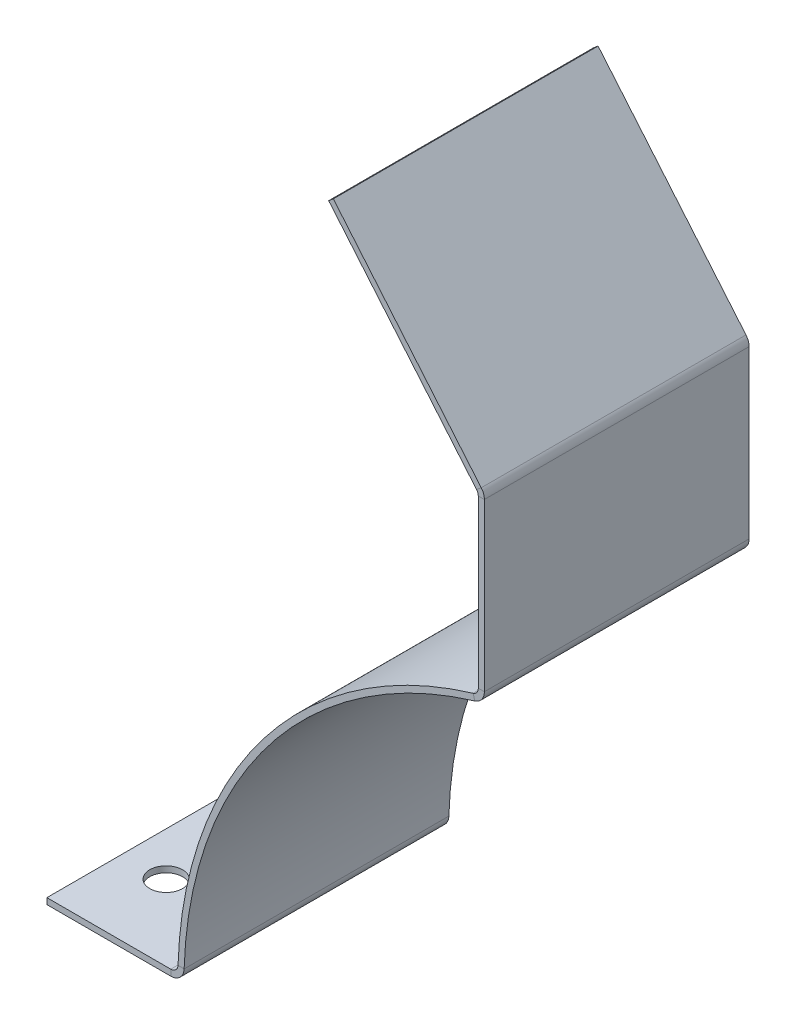
ISO-10303-21;
HEADER;
FILE_DESCRIPTION(('STEP AP214'),'2;1');
FILE_NAME('part.step','',(''),(''),'','','');
FILE_SCHEMA(('AUTOMOTIVE_DESIGN { 1 0 10303 214 1 1 1 1 }'));
ENDSEC;
DATA;
#1=APPLICATION_CONTEXT('core data for automotive mechanical design processes');
#2=APPLICATION_PROTOCOL_DEFINITION('international standard','automotive_design',2000,#1);
#3=PRODUCT_CONTEXT('',#1,'mechanical');
#4=PRODUCT('Part','Part','',(#3));
#5=PRODUCT_RELATED_PRODUCT_CATEGORY('part','',(#4));
#6=PRODUCT_DEFINITION_FORMATION('','',#4);
#7=PRODUCT_DEFINITION_CONTEXT('part definition',#1,'design');
#8=PRODUCT_DEFINITION('design','',#6,#7);
#9=PRODUCT_DEFINITION_SHAPE('','',#8);
#10=(LENGTH_UNIT() NAMED_UNIT(*) SI_UNIT(.MILLI.,.METRE.));
#11=(NAMED_UNIT(*) PLANE_ANGLE_UNIT() SI_UNIT($,.RADIAN.));
#12=(NAMED_UNIT(*) SI_UNIT($,.STERADIAN.) SOLID_ANGLE_UNIT());
#13=UNCERTAINTY_MEASURE_WITH_UNIT(LENGTH_MEASURE(1.E-05),#10,'distance_accuracy_value','');
#14=(GEOMETRIC_REPRESENTATION_CONTEXT(3) GLOBAL_UNCERTAINTY_ASSIGNED_CONTEXT((#13)) GLOBAL_UNIT_ASSIGNED_CONTEXT((#10,
#11,#12)) REPRESENTATION_CONTEXT('',''));
#15=CARTESIAN_POINT('',(0.,0.,0.));
#16=DIRECTION('',(0.,0.,1.));
#17=DIRECTION('',(1.,0.,0.));
#18=AXIS2_PLACEMENT_3D('',#15,#16,#17);
#19=CARTESIAN_POINT('',(-46.6343359967597,173.610704407755,0.));
#20=DIRECTION('',(0.,0.,-1.));
#21=DIRECTION('',(-1.,0.,0.));
#22=AXIS2_PLACEMENT_3D('',#19,#20,#21);
#23=PLANE('',#22);
#24=DIRECTION('',(-2.70456049811991E-05,0.999999999634268,0.));
#25=VECTOR('',#24,1.);
#26=CARTESIAN_POINT('',(-49.286498840737,0.67476912651559,0.));
#27=LINE('',#26,#25);
#28=CARTESIAN_POINT('',(-49.2932056168379,248.655027030668,0.));
#29=VERTEX_POINT('',#28);
#30=CARTESIAN_POINT('',(-49.2912400011612,175.977204615523,0.));
#31=VERTEX_POINT('',#30);
#32=EDGE_CURVE('E289',#29,#31,#27,.F.);
#33=ORIENTED_EDGE('',*,*,#32,.F.);
#34=DIRECTION('',(0.999999999634268,2.7045604985661E-05,0.));
#35=VECTOR('',#34,1.);
#36=CARTESIAN_POINT('',(-49.2932056168379,248.655027030668,0.));
#37=LINE('',#36,#35);
#38=CARTESIAN_POINT('',(-46.6363656178096,248.655098886514,0.));
#39=VERTEX_POINT('',#38);
#40=EDGE_CURVE('E271',#29,#39,#37,.T.);
#41=ORIENTED_EDGE('',*,*,#40,.T.);
#42=DIRECTION('',(2.70456049811991E-05,-0.999999999634268,0.));
#43=VECTOR('',#42,1.);
#44=CARTESIAN_POINT('',(-46.6343359967597,173.610704407755,0.));
#45=LINE('',#44,#43);
#46=CARTESIAN_POINT('',(-46.6344000021329,175.977276471369,0.));
#47=VERTEX_POINT('',#46);
#48=EDGE_CURVE('E157',#39,#47,#45,.T.);
#49=ORIENTED_EDGE('',*,*,#48,.T.);
#50=DIRECTION('',(0.999999999634268,2.70456049811991E-05,0.));
#51=VECTOR('',#50,1.);
#52=CARTESIAN_POINT('',(-49.2912400011612,175.977204615524,0.));
#53=LINE('',#52,#51);
#54=EDGE_CURVE('E298',#31,#47,#53,.T.);
#55=ORIENTED_EDGE('',*,*,#54,.F.);
#56=EDGE_LOOP('',(#33,#41,#49,#55));
#57=FACE_BOUND('',#56,.T.);
#58=ADVANCED_FACE('F81',(#57),#23,.T.);
#59=CARTESIAN_POINT('',(-46.6296588417087,0.674840982360728,0.));
#60=DIRECTION('',(0.999999999634268,2.70456049811991E-05,0.));
#61=DIRECTION('',(-2.70456049811991E-05,0.999999999634268,0.));
#62=AXIS2_PLACEMENT_3D('',#59,#60,#61);
#63=PLANE('',#62);
#64=ORIENTED_EDGE('',*,*,#48,.F.);
#65=DIRECTION('',(0.,0.,-1.));
#66=VECTOR('',#65,1.);
#67=CARTESIAN_POINT('',(-46.6363656178096,248.655098886514,0.));
#68=LINE('',#67,#66);
#69=CARTESIAN_POINT('',(-46.6363656178095,248.655098886514,115.57));
#70=VERTEX_POINT('',#69);
#71=EDGE_CURVE('E266',#39,#70,#68,.F.);
#72=ORIENTED_EDGE('',*,*,#71,.T.);
#73=DIRECTION('',(-2.70456049811991E-05,0.999999999634268,0.));
#74=VECTOR('',#73,1.);
#75=CARTESIAN_POINT('',(-46.6363968718592,249.810704379886,115.57));
#76=LINE('',#75,#74);
#77=CARTESIAN_POINT('',(-46.6344000021329,175.977276471369,115.57));
#78=VERTEX_POINT('',#77);
#79=EDGE_CURVE('E161',#78,#70,#76,.T.);
#80=ORIENTED_EDGE('',*,*,#79,.F.);
#81=DIRECTION('',(0.,0.,-1.));
#82=VECTOR('',#81,1.);
#83=CARTESIAN_POINT('',(-46.6344000021329,175.977276471369,0.));
#84=LINE('',#83,#82);
#85=EDGE_CURVE('E295',#78,#47,#84,.T.);
#86=ORIENTED_EDGE('',*,*,#85,.T.);
#87=EDGE_LOOP('',(#64,#72,#80,#86));
#88=FACE_BOUND('',#87,.T.);
#89=ADVANCED_FACE('F320',(#88),#63,.T.);
#90=CARTESIAN_POINT('',(-49.286498840737,0.67476912651559,0.));
#91=DIRECTION('',(0.999999999634268,2.70456049811991E-05,0.));
#92=DIRECTION('',(-2.70456049811991E-05,0.999999999634268,0.));
#93=AXIS2_PLACEMENT_3D('',#90,#91,#92);
#94=PLANE('',#93);
#95=DIRECTION('',(0.,0.,-1.));
#96=VECTOR('',#95,1.);
#97=CARTESIAN_POINT('',(-49.2932056168379,248.655027030668,0.));
#98=LINE('',#97,#96);
#99=CARTESIAN_POINT('',(-49.2932056168379,248.655027030668,115.57));
#100=VERTEX_POINT('',#99);
#101=EDGE_CURVE('E277',#29,#100,#98,.F.);
#102=ORIENTED_EDGE('',*,*,#101,.F.);
#103=ORIENTED_EDGE('',*,*,#32,.T.);
#104=DIRECTION('',(0.,0.,1.));
#105=VECTOR('',#104,1.);
#106=CARTESIAN_POINT('',(-49.2912400011612,175.977204615524,115.57));
#107=LINE('',#106,#105);
#108=CARTESIAN_POINT('',(-49.2912400011612,175.977204615524,115.57));
#109=VERTEX_POINT('',#108);
#110=EDGE_CURVE('E155',#109,#31,#107,.F.);
#111=ORIENTED_EDGE('',*,*,#110,.F.);
#112=DIRECTION('',(2.70456049811991E-05,-0.999999999634268,0.));
#113=VECTOR('',#112,1.);
#114=CARTESIAN_POINT('',(-49.286498840737,0.674769126515611,115.57));
#115=LINE('',#114,#113);
#116=EDGE_CURVE('E292',#109,#100,#115,.F.);
#117=ORIENTED_EDGE('',*,*,#116,.T.);
#118=EDGE_LOOP('',(#102,#103,#111,#117));
#119=FACE_BOUND('',#118,.T.);
#120=ADVANCED_FACE('F341',(#119),#94,.F.);
#121=CARTESIAN_POINT('',(0.,0.,115.57));
#122=DIRECTION('',(0.,0.,-1.));
#123=DIRECTION('',(-1.,0.,0.));
#124=AXIS2_PLACEMENT_3D('',#121,#122,#123);
#125=CYLINDRICAL_SURFACE('',#124,180.45684);
#126=CARTESIAN_POINT('',(0.,0.,0.));
#127=DIRECTION('',(0.,0.,1.));
#128=DIRECTION('',(1.,0.,0.));
#129=AXIS2_PLACEMENT_3D('',#126,#127,#128);
#130=CIRCLE('',#129,180.45684);
#131=CARTESIAN_POINT('',(-51.5590971428571,172.934469104916,0.));
#132=VERTEX_POINT('',#131);
#133=CARTESIAN_POINT('',(-180.366311024075,5.71532591828572,0.));
#134=VERTEX_POINT('',#133);
#135=EDGE_CURVE('E120',#132,#134,#130,.T.);
#136=ORIENTED_EDGE('',*,*,#135,.T.);
#137=DIRECTION('',(0.,0.,-1.));
#138=VECTOR('',#137,1.);
#139=CARTESIAN_POINT('',(-180.366311024075,5.71532591828572,115.57));
#140=LINE('',#139,#138);
#141=CARTESIAN_POINT('',(-180.366311024075,5.71532591828572,115.57));
#142=VERTEX_POINT('',#141);
#143=EDGE_CURVE('E13',#142,#134,#140,.T.);
#144=ORIENTED_EDGE('',*,*,#143,.F.);
#145=CARTESIAN_POINT('',(0.,0.,115.57));
#146=DIRECTION('',(0.,0.,1.));
#147=DIRECTION('',(1.,0.,0.));
#148=AXIS2_PLACEMENT_3D('',#145,#146,#147);
#149=CIRCLE('',#148,180.45684);
#150=CARTESIAN_POINT('',(-51.5590971428571,172.934469104916,115.57));
#151=VERTEX_POINT('',#150);
#152=EDGE_CURVE('E105',#151,#142,#149,.T.);
#153=ORIENTED_EDGE('',*,*,#152,.F.);
#154=DIRECTION('',(0.,0.,-1.));
#155=VECTOR('',#154,1.);
#156=CARTESIAN_POINT('',(-51.5590971428571,172.934469104916,115.57));
#157=LINE('',#156,#155);
#158=EDGE_CURVE('E117',#151,#132,#157,.T.);
#159=ORIENTED_EDGE('',*,*,#158,.T.);
#160=EDGE_LOOP('',(#136,#144,#153,#159));
#161=FACE_BOUND('',#160,.T.);
#162=ADVANCED_FACE('F83',(#161),#125,.T.);
#163=CARTESIAN_POINT('',(0.,0.,115.57));
#164=DIRECTION('',(0.,0.,-1.));
#165=DIRECTION('',(-1.,0.,0.));
#166=AXIS2_PLACEMENT_3D('',#163,#164,#165);
#167=CYLINDRICAL_SURFACE('',#166,177.8);
#168=CARTESIAN_POINT('',(0.,0.,0.));
#169=DIRECTION('',(0.,0.,1.));
#170=DIRECTION('',(1.,0.,0.));
#171=AXIS2_PLACEMENT_3D('',#168,#169,#170);
#172=CIRCLE('',#171,177.8);
#173=CARTESIAN_POINT('',(-50.7999999999999,170.388379885484,0.));
#174=VERTEX_POINT('',#173);
#175=CARTESIAN_POINT('',(-177.710803869116,5.63118000000001,0.));
#176=VERTEX_POINT('',#175);
#177=EDGE_CURVE('E150',#174,#176,#172,.T.);
#178=ORIENTED_EDGE('',*,*,#177,.F.);
#179=DIRECTION('',(0.,0.,-1.));
#180=VECTOR('',#179,1.);
#181=CARTESIAN_POINT('',(-50.8,170.388379885484,115.57));
#182=LINE('',#181,#180);
#183=CARTESIAN_POINT('',(-50.8,170.388379885484,115.57));
#184=VERTEX_POINT('',#183);
#185=EDGE_CURVE('E126',#184,#174,#182,.T.);
#186=ORIENTED_EDGE('',*,*,#185,.F.);
#187=CARTESIAN_POINT('',(0.,0.,115.57));
#188=DIRECTION('',(0.,0.,1.));
#189=DIRECTION('',(1.,0.,0.));
#190=AXIS2_PLACEMENT_3D('',#187,#188,#189);
#191=CIRCLE('',#190,177.8);
#192=CARTESIAN_POINT('',(-177.710803869116,5.63118000000001,115.57));
#193=VERTEX_POINT('',#192);
#194=EDGE_CURVE('E169',#184,#193,#191,.T.);
#195=ORIENTED_EDGE('',*,*,#194,.T.);
#196=DIRECTION('',(0.,0.,-1.));
#197=VECTOR('',#196,1.);
#198=CARTESIAN_POINT('',(-177.710803869116,5.63118000000001,115.57));
#199=LINE('',#198,#197);
#200=EDGE_CURVE('E89',#193,#176,#199,.T.);
#201=ORIENTED_EDGE('',*,*,#200,.T.);
#202=EDGE_LOOP('',(#178,#186,#195,#201));
#203=FACE_BOUND('',#202,.T.);
#204=ADVANCED_FACE('F180',(#203),#167,.F.);
#205=CARTESIAN_POINT('',(0.,0.,115.57));
#206=DIRECTION('',(0.,0.,1.));
#207=DIRECTION('',(1.,0.,0.));
#208=AXIS2_PLACEMENT_3D('',#205,#206,#207);
#209=PLANE('',#208);
#210=ORIENTED_EDGE('',*,*,#152,.T.);
#211=DIRECTION('',(-0.999498334471971,0.031671428571428,0.));
#212=VECTOR('',#211,1.);
#213=CARTESIAN_POINT('',(-177.710803869116,5.63118000000001,115.57));
#214=LINE('',#213,#212);
#215=EDGE_CURVE('E166',#193,#142,#214,.T.);
#216=ORIENTED_EDGE('',*,*,#215,.F.);
#217=ORIENTED_EDGE('',*,*,#194,.F.);
#218=DIRECTION('',(0.285714285714285,-0.95831484749991,0.));
#219=VECTOR('',#218,1.);
#220=CARTESIAN_POINT('',(-51.5590971428571,172.934469104916,115.57));
#221=LINE('',#220,#219);
#222=EDGE_CURVE('E127',#151,#184,#221,.T.);
#223=ORIENTED_EDGE('',*,*,#222,.F.);
#224=EDGE_LOOP('',(#210,#216,#217,#223));
#225=FACE_BOUND('',#224,.T.);
#226=ADVANCED_FACE('F208',(#225),#209,.T.);
#227=CARTESIAN_POINT('',(0.,0.,0.));
#228=DIRECTION('',(0.,0.,1.));
#229=DIRECTION('',(1.,0.,0.));
#230=AXIS2_PLACEMENT_3D('',#227,#228,#229);
#231=PLANE('',#230);
#232=ORIENTED_EDGE('',*,*,#135,.F.);
#233=DIRECTION('',(0.285714285714285,-0.95831484749991,0.));
#234=VECTOR('',#233,1.);
#235=CARTESIAN_POINT('',(-51.5590971428571,172.934469104916,0.));
#236=LINE('',#235,#234);
#237=EDGE_CURVE('E134',#132,#174,#236,.T.);
#238=ORIENTED_EDGE('',*,*,#237,.T.);
#239=ORIENTED_EDGE('',*,*,#177,.T.);
#240=DIRECTION('',(-0.999498334471971,0.031671428571428,0.));
#241=VECTOR('',#240,1.);
#242=CARTESIAN_POINT('',(-177.710803869116,5.63118000000001,0.));
#243=LINE('',#242,#241);
#244=EDGE_CURVE('E137',#176,#134,#243,.T.);
#245=ORIENTED_EDGE('',*,*,#244,.T.);
#246=EDGE_LOOP('',(#232,#238,#239,#245));
#247=FACE_BOUND('',#246,.T.);
#248=ADVANCED_FACE('F132',(#247),#231,.F.);
#249=CARTESIAN_POINT('',(-52.46624,175.977118745728,115.57));
#250=DIRECTION('',(0.,0.,1.));
#251=DIRECTION('',(0.,-1.,0.));
#252=AXIS2_PLACEMENT_3D('',#249,#250,#251);
#253=PLANE('',#252);
#254=DIRECTION('',(0.999999999634268,2.70456049811991E-05,0.));
#255=VECTOR('',#254,1.);
#256=CARTESIAN_POINT('',(-46.6344000021329,175.977276471369,115.57));
#257=LINE('',#256,#255);
#258=EDGE_CURVE('E284',#109,#78,#257,.T.);
#259=ORIENTED_EDGE('',*,*,#258,.F.);
#260=CARTESIAN_POINT('',(-52.46624,175.977118745728,115.57));
#261=DIRECTION('',(0.,0.,-1.));
#262=DIRECTION('',(0.,1.,0.));
#263=AXIS2_PLACEMENT_3D('',#260,#261,#262);
#264=CIRCLE('',#263,3.17499999999999);
#265=EDGE_CURVE('E156',#151,#109,#264,.F.);
#266=ORIENTED_EDGE('',*,*,#265,.F.);
#267=ORIENTED_EDGE('',*,*,#222,.T.);
#268=CARTESIAN_POINT('',(-52.46624,175.977118745728,115.57));
#269=DIRECTION('',(0.,0.,-1.));
#270=DIRECTION('',(0.,1.,0.));
#271=AXIS2_PLACEMENT_3D('',#268,#269,#270);
#272=CIRCLE('',#271,5.83183999999999);
#273=EDGE_CURVE('E138',#184,#78,#272,.F.);
#274=ORIENTED_EDGE('',*,*,#273,.T.);
#275=EDGE_LOOP('',(#259,#266,#267,#274));
#276=FACE_BOUND('',#275,.T.);
#277=ADVANCED_FACE('F308',(#276),#253,.T.);
#278=CARTESIAN_POINT('',(-52.46624,175.977118745728,0.));
#279=DIRECTION('',(0.,0.,1.));
#280=DIRECTION('',(0.,-1.,0.));
#281=AXIS2_PLACEMENT_3D('',#278,#279,#280);
#282=PLANE('',#281);
#283=CARTESIAN_POINT('',(-52.46624,175.977118745728,0.));
#284=DIRECTION('',(0.,0.,-1.));
#285=DIRECTION('',(0.,1.,0.));
#286=AXIS2_PLACEMENT_3D('',#283,#284,#285);
#287=CIRCLE('',#286,3.17499999999999);
#288=EDGE_CURVE('E146',#31,#132,#287,.T.);
#289=ORIENTED_EDGE('',*,*,#288,.F.);
#290=ORIENTED_EDGE('',*,*,#54,.T.);
#291=CARTESIAN_POINT('',(-52.46624,175.977118745728,0.));
#292=DIRECTION('',(0.,0.,-1.));
#293=DIRECTION('',(0.,1.,0.));
#294=AXIS2_PLACEMENT_3D('',#291,#292,#293);
#295=CIRCLE('',#294,5.83183999999999);
#296=EDGE_CURVE('E149',#47,#174,#295,.T.);
#297=ORIENTED_EDGE('',*,*,#296,.T.);
#298=ORIENTED_EDGE('',*,*,#237,.F.);
#299=EDGE_LOOP('',(#289,#290,#297,#298));
#300=FACE_BOUND('',#299,.T.);
#301=ADVANCED_FACE('F143',(#300),#282,.F.);
#302=CARTESIAN_POINT('',(-52.46624,175.977118745728,0.));
#303=DIRECTION('',(0.,0.,-1.));
#304=DIRECTION('',(0.999999999634268,2.70456049811991E-05,0.));
#305=AXIS2_PLACEMENT_3D('',#302,#303,#304);
#306=CYLINDRICAL_SURFACE('',#305,5.83183999999999);
#307=ORIENTED_EDGE('',*,*,#185,.T.);
#308=ORIENTED_EDGE('',*,*,#296,.F.);
#309=ORIENTED_EDGE('',*,*,#85,.F.);
#310=ORIENTED_EDGE('',*,*,#273,.F.);
#311=EDGE_LOOP('',(#307,#308,#309,#310));
#312=FACE_BOUND('',#311,.T.);
#313=ADVANCED_FACE('F445',(#312),#306,.T.);
#314=CARTESIAN_POINT('',(-52.46624,175.977118745728,0.));
#315=DIRECTION('',(0.,0.,-1.));
#316=DIRECTION('',(0.999999999634268,2.70456049811991E-05,0.));
#317=AXIS2_PLACEMENT_3D('',#314,#315,#316);
#318=CYLINDRICAL_SURFACE('',#317,3.17499999999999);
#319=ORIENTED_EDGE('',*,*,#158,.F.);
#320=ORIENTED_EDGE('',*,*,#265,.T.);
#321=ORIENTED_EDGE('',*,*,#110,.T.);
#322=ORIENTED_EDGE('',*,*,#288,.T.);
#323=EDGE_LOOP('',(#319,#320,#321,#322));
#324=FACE_BOUND('',#323,.T.);
#325=ADVANCED_FACE('F153',(#324),#318,.F.);
#326=CARTESIAN_POINT('',(-46.6363968718592,249.810704379886,115.57));
#327=DIRECTION('',(0.,0.,1.));
#328=DIRECTION('',(0.,-1.,0.));
#329=AXIS2_PLACEMENT_3D('',#326,#327,#328);
#330=PLANE('',#329);
#331=DIRECTION('',(0.999999999634268,2.7045604985661E-05,0.));
#332=VECTOR('',#331,1.);
#333=CARTESIAN_POINT('',(-49.2932056168379,248.655027030668,115.57));
#334=LINE('',#333,#332);
#335=EDGE_CURVE('E282',#100,#70,#334,.T.);
#336=ORIENTED_EDGE('',*,*,#335,.F.);
#337=ORIENTED_EDGE('',*,*,#116,.F.);
#338=ORIENTED_EDGE('',*,*,#258,.T.);
#339=ORIENTED_EDGE('',*,*,#79,.T.);
#340=EDGE_LOOP('',(#336,#337,#338,#339));
#341=FACE_BOUND('',#340,.T.);
#342=ADVANCED_FACE('F317',(#341),#330,.T.);
#343=CARTESIAN_POINT('',(-52.4682056156767,248.654941160873,115.57));
#344=DIRECTION('',(0.,0.,1.));
#345=DIRECTION('',(1.,0.,0.));
#346=AXIS2_PLACEMENT_3D('',#343,#344,#345);
#347=PLANE('',#346);
#348=DIRECTION('',(0.766027058259036,0.642808327586853,0.));
#349=VECTOR('',#348,1.);
#350=CARTESIAN_POINT('',(-50.0360697057042,250.695857600961,115.57));
#351=LINE('',#350,#349);
#352=CARTESIAN_POINT('',(-50.0360697057043,250.695857600961,115.57));
#353=VERTEX_POINT('',#352);
#354=CARTESIAN_POINT('',(-48.0008583762393,252.403696478027,115.57));
#355=VERTEX_POINT('',#354);
#356=EDGE_CURVE('E234',#353,#355,#351,.T.);
#357=ORIENTED_EDGE('',*,*,#356,.F.);
#358=CARTESIAN_POINT('',(-52.4682056156767,248.654941160873,115.57));
#359=DIRECTION('',(0.,0.,-1.));
#360=DIRECTION('',(-1.,0.,0.));
#361=AXIS2_PLACEMENT_3D('',#358,#359,#360);
#362=CIRCLE('',#361,3.17500000000001);
#363=EDGE_CURVE('E274',#100,#353,#362,.F.);
#364=ORIENTED_EDGE('',*,*,#363,.F.);
#365=ORIENTED_EDGE('',*,*,#335,.T.);
#366=CARTESIAN_POINT('',(-52.4682056156767,248.654941160873,115.57));
#367=DIRECTION('',(0.,0.,-1.));
#368=DIRECTION('',(-1.,0.,0.));
#369=AXIS2_PLACEMENT_3D('',#366,#367,#368);
#370=CIRCLE('',#369,5.83184000000001);
#371=EDGE_CURVE('E96',#70,#355,#370,.F.);
#372=ORIENTED_EDGE('',*,*,#371,.T.);
#373=EDGE_LOOP('',(#357,#364,#365,#372));
#374=FACE_BOUND('',#373,.T.);
#375=ADVANCED_FACE('F444',(#374),#347,.T.);
#376=CARTESIAN_POINT('',(-52.4682056156767,248.654941160873,0.));
#377=DIRECTION('',(0.,0.,1.));
#378=DIRECTION('',(1.,0.,0.));
#379=AXIS2_PLACEMENT_3D('',#376,#377,#378);
#380=PLANE('',#379);
#381=CARTESIAN_POINT('',(-52.4682056156767,248.654941160873,0.));
#382=DIRECTION('',(0.,0.,-1.));
#383=DIRECTION('',(-1.,0.,0.));
#384=AXIS2_PLACEMENT_3D('',#381,#382,#383);
#385=CIRCLE('',#384,3.17500000000001);
#386=CARTESIAN_POINT('',(-50.0360697057043,250.695857600961,0.));
#387=VERTEX_POINT('',#386);
#388=EDGE_CURVE('E265',#387,#29,#385,.T.);
#389=ORIENTED_EDGE('',*,*,#388,.F.);
#390=DIRECTION('',(0.766027058259036,0.642808327586853,0.));
#391=VECTOR('',#390,1.);
#392=CARTESIAN_POINT('',(-50.0360697057042,250.695857600961,0.));
#393=LINE('',#392,#391);
#394=CARTESIAN_POINT('',(-48.0008583762393,252.403696478027,0.));
#395=VERTEX_POINT('',#394);
#396=EDGE_CURVE('E233',#387,#395,#393,.T.);
#397=ORIENTED_EDGE('',*,*,#396,.T.);
#398=CARTESIAN_POINT('',(-52.4682056156767,248.654941160873,0.));
#399=DIRECTION('',(0.,0.,-1.));
#400=DIRECTION('',(-1.,0.,0.));
#401=AXIS2_PLACEMENT_3D('',#398,#399,#400);
#402=CIRCLE('',#401,5.83184000000001);
#403=EDGE_CURVE('E269',#395,#39,#402,.T.);
#404=ORIENTED_EDGE('',*,*,#403,.T.);
#405=ORIENTED_EDGE('',*,*,#40,.F.);
#406=EDGE_LOOP('',(#389,#397,#404,#405));
#407=FACE_BOUND('',#406,.T.);
#408=ADVANCED_FACE('F330',(#407),#380,.F.);
#409=CARTESIAN_POINT('',(-52.4682056156767,248.654941160873,0.));
#410=DIRECTION('',(0.,0.,-1.));
#411=DIRECTION('',(0.766027058259036,0.642808327586853,0.));
#412=AXIS2_PLACEMENT_3D('',#409,#410,#411);
#413=CYLINDRICAL_SURFACE('',#412,5.83184000000001);
#414=ORIENTED_EDGE('',*,*,#71,.F.);
#415=ORIENTED_EDGE('',*,*,#403,.F.);
#416=DIRECTION('',(0.,0.,1.));
#417=VECTOR('',#416,1.);
#418=CARTESIAN_POINT('',(-48.0008583762393,252.403696478027,0.));
#419=LINE('',#418,#417);
#420=EDGE_CURVE('E237',#395,#355,#419,.T.);
#421=ORIENTED_EDGE('',*,*,#420,.T.);
#422=ORIENTED_EDGE('',*,*,#371,.F.);
#423=EDGE_LOOP('',(#414,#415,#421,#422));
#424=FACE_BOUND('',#423,.T.);
#425=ADVANCED_FACE('F324',(#424),#413,.T.);
#426=CARTESIAN_POINT('',(-52.4682056156767,248.654941160873,0.));
#427=DIRECTION('',(0.,0.,-1.));
#428=DIRECTION('',(0.766027058259036,0.642808327586853,0.));
#429=AXIS2_PLACEMENT_3D('',#426,#427,#428);
#430=CYLINDRICAL_SURFACE('',#429,3.17500000000001);
#431=ORIENTED_EDGE('',*,*,#101,.T.);
#432=ORIENTED_EDGE('',*,*,#363,.T.);
#433=DIRECTION('',(0.,0.,-1.));
#434=VECTOR('',#433,1.);
#435=CARTESIAN_POINT('',(-50.0360697057042,250.695857600961,115.57));
#436=LINE('',#435,#434);
#437=EDGE_CURVE('E230',#353,#387,#436,.T.);
#438=ORIENTED_EDGE('',*,*,#437,.T.);
#439=ORIENTED_EDGE('',*,*,#388,.T.);
#440=EDGE_LOOP('',(#431,#432,#438,#439));
#441=FACE_BOUND('',#440,.T.);
#442=ADVANCED_FACE('F583',(#441),#430,.F.);
#443=CARTESIAN_POINT('',(-47.2580255414226,251.518471401107,115.57));
#444=DIRECTION('',(0.,0.,-1.));
#445=DIRECTION('',(-1.,0.,0.));
#446=AXIS2_PLACEMENT_3D('',#443,#444,#445);
#447=PLANE('',#446);
#448=ORIENTED_EDGE('',*,*,#356,.T.);
#449=DIRECTION('',(0.642808327586853,-0.766027058259036,0.));
#450=VECTOR('',#449,1.);
#451=CARTESIAN_POINT('',(-47.2580255414226,251.518471401107,115.57));
#452=LINE('',#451,#450);
#453=CARTESIAN_POINT('',(-112.567351624247,329.346820520225,115.57));
#454=VERTEX_POINT('',#453);
#455=EDGE_CURVE('E242',#454,#355,#452,.T.);
#456=ORIENTED_EDGE('',*,*,#455,.F.);
#457=DIRECTION('',(-0.766027058259036,-0.642808327586853,0.));
#458=VECTOR('',#457,1.);
#459=CARTESIAN_POINT('',(-112.567351624247,329.346820520225,115.57));
#460=LINE('',#459,#458);
#461=CARTESIAN_POINT('',(-114.602562953712,327.638981643159,115.57));
#462=VERTEX_POINT('',#461);
#463=EDGE_CURVE('E252',#454,#462,#460,.T.);
#464=ORIENTED_EDGE('',*,*,#463,.T.);
#465=DIRECTION('',(0.642808327586853,-0.766027058259036,0.));
#466=VECTOR('',#465,1.);
#467=CARTESIAN_POINT('',(-49.2932368708876,249.810632524041,115.57));
#468=LINE('',#467,#466);
#469=EDGE_CURVE('E241',#462,#353,#468,.T.);
#470=ORIENTED_EDGE('',*,*,#469,.T.);
#471=EDGE_LOOP('',(#448,#456,#464,#470));
#472=FACE_BOUND('',#471,.T.);
#473=ADVANCED_FACE('F572',(#472),#447,.F.);
#474=CARTESIAN_POINT('',(-112.567351624247,329.346820520225,0.));
#475=DIRECTION('',(0.,0.,1.));
#476=DIRECTION('',(0.,-1.,0.));
#477=AXIS2_PLACEMENT_3D('',#474,#475,#476);
#478=PLANE('',#477);
#479=ORIENTED_EDGE('',*,*,#396,.F.);
#480=DIRECTION('',(-0.642808327586853,0.766027058259036,0.));
#481=VECTOR('',#480,1.);
#482=CARTESIAN_POINT('',(-114.602562953712,327.638981643159,0.));
#483=LINE('',#482,#481);
#484=CARTESIAN_POINT('',(-114.602562953712,327.638981643159,0.));
#485=VERTEX_POINT('',#484);
#486=EDGE_CURVE('E255',#387,#485,#483,.T.);
#487=ORIENTED_EDGE('',*,*,#486,.T.);
#488=DIRECTION('',(-0.766027058259036,-0.642808327586853,0.));
#489=VECTOR('',#488,1.);
#490=CARTESIAN_POINT('',(-112.567351624247,329.346820520225,0.));
#491=LINE('',#490,#489);
#492=CARTESIAN_POINT('',(-112.567351624247,329.346820520225,0.));
#493=VERTEX_POINT('',#492);
#494=EDGE_CURVE('E262',#493,#485,#491,.T.);
#495=ORIENTED_EDGE('',*,*,#494,.F.);
#496=DIRECTION('',(-0.642808327586853,0.766027058259036,0.));
#497=VECTOR('',#496,1.);
#498=CARTESIAN_POINT('',(-112.567351624247,329.346820520225,0.));
#499=LINE('',#498,#497);
#500=EDGE_CURVE('E245',#395,#493,#499,.T.);
#501=ORIENTED_EDGE('',*,*,#500,.F.);
#502=EDGE_LOOP('',(#479,#487,#495,#501));
#503=FACE_BOUND('',#502,.T.);
#504=ADVANCED_FACE('F561',(#503),#478,.F.);
#505=CARTESIAN_POINT('',(96.1189623179318,80.6578158706245,0.));
#506=DIRECTION('',(-0.766027058259036,-0.642808327586853,0.));
#507=DIRECTION('',(0.642808327586853,-0.766027058259036,0.));
#508=AXIS2_PLACEMENT_3D('',#505,#506,#507);
#509=PLANE('',#508);
#510=ORIENTED_EDGE('',*,*,#420,.F.);
#511=ORIENTED_EDGE('',*,*,#500,.T.);
#512=DIRECTION('',(0.,0.,1.));
#513=VECTOR('',#512,1.);
#514=CARTESIAN_POINT('',(-112.567351624247,329.346820520225,115.57));
#515=LINE('',#514,#513);
#516=EDGE_CURVE('E249',#493,#454,#515,.T.);
#517=ORIENTED_EDGE('',*,*,#516,.T.);
#518=ORIENTED_EDGE('',*,*,#455,.T.);
#519=EDGE_LOOP('',(#510,#511,#517,#518));
#520=FACE_BOUND('',#519,.T.);
#521=ADVANCED_FACE('F550',(#520),#509,.F.);
#522=CARTESIAN_POINT('',(94.0837509884668,78.9499769935587,0.));
#523=DIRECTION('',(-0.766027058259036,-0.642808327586853,0.));
#524=DIRECTION('',(0.642808327586853,-0.766027058259036,0.));
#525=AXIS2_PLACEMENT_3D('',#522,#523,#524);
#526=PLANE('',#525);
#527=ORIENTED_EDGE('',*,*,#486,.F.);
#528=ORIENTED_EDGE('',*,*,#437,.F.);
#529=ORIENTED_EDGE('',*,*,#469,.F.);
#530=DIRECTION('',(0.,0.,1.));
#531=VECTOR('',#530,1.);
#532=CARTESIAN_POINT('',(-114.602562953712,327.638981643159,115.57));
#533=LINE('',#532,#531);
#534=EDGE_CURVE('E246',#485,#462,#533,.T.);
#535=ORIENTED_EDGE('',*,*,#534,.F.);
#536=EDGE_LOOP('',(#527,#528,#529,#535));
#537=FACE_BOUND('',#536,.T.);
#538=ADVANCED_FACE('F537',(#537),#526,.T.);
#539=CARTESIAN_POINT('',(-112.567351624247,329.346820520225,115.57));
#540=DIRECTION('',(0.642808327586853,-0.766027058259036,0.));
#541=DIRECTION('',(0.766027058259036,0.642808327586853,0.));
#542=AXIS2_PLACEMENT_3D('',#539,#540,#541);
#543=PLANE('',#542);
#544=ORIENTED_EDGE('',*,*,#534,.T.);
#545=ORIENTED_EDGE('',*,*,#463,.F.);
#546=ORIENTED_EDGE('',*,*,#516,.F.);
#547=ORIENTED_EDGE('',*,*,#494,.T.);
#548=EDGE_LOOP('',(#544,#545,#546,#547));
#549=FACE_BOUND('',#548,.T.);
#550=ADVANCED_FACE('F532',(#549),#543,.F.);
#551=CARTESIAN_POINT('',(-183.539718236024,5.815882704,0.));
#552=DIRECTION('',(0.,0.,-1.));
#553=DIRECTION('',(-1.,0.,0.));
#554=AXIS2_PLACEMENT_3D('',#551,#552,#553);
#555=PLANE('',#554);
#556=DIRECTION('',(-8.62663278542215E-05,-0.99999999627906,0.));
#557=VECTOR('',#556,1.);
#558=CARTESIAN_POINT('',(-183.540221327445,-0.0159572743000692,0.));
#559=LINE('',#558,#557);
#560=CARTESIAN_POINT('',(-183.539992131614,2.64088271581396,0.));
#561=VERTEX_POINT('',#560);
#562=CARTESIAN_POINT('',(-183.540221327445,-0.0159572743000944,0.));
#563=VERTEX_POINT('',#562);
#564=EDGE_CURVE('E224',#561,#563,#559,.T.);
#565=ORIENTED_EDGE('',*,*,#564,.F.);
#566=CARTESIAN_POINT('',(-183.539718236024,5.815882704,0.));
#567=DIRECTION('',(0.,0.,1.));
#568=DIRECTION('',(1.,0.,0.));
#569=AXIS2_PLACEMENT_3D('',#566,#567,#568);
#570=CIRCLE('',#569,3.17500000000002);
#571=EDGE_CURVE('E205',#134,#561,#570,.F.);
#572=ORIENTED_EDGE('',*,*,#571,.F.);
#573=ORIENTED_EDGE('',*,*,#244,.F.);
#574=CARTESIAN_POINT('',(-183.539718236024,5.815882704,0.));
#575=DIRECTION('',(0.,0.,1.));
#576=DIRECTION('',(1.,0.,0.));
#577=AXIS2_PLACEMENT_3D('',#574,#575,#576);
#578=CIRCLE('',#577,5.83184000000002);
#579=EDGE_CURVE('E192',#176,#563,#578,.F.);
#580=ORIENTED_EDGE('',*,*,#579,.T.);
#581=EDGE_LOOP('',(#565,#572,#573,#580));
#582=FACE_BOUND('',#581,.T.);
#583=ADVANCED_FACE('F222',(#582),#555,.T.);
#584=CARTESIAN_POINT('',(-183.539718236024,5.815882704,115.57));
#585=DIRECTION('',(0.,0.,-1.));
#586=DIRECTION('',(-1.,0.,0.));
#587=AXIS2_PLACEMENT_3D('',#584,#585,#586);
#588=PLANE('',#587);
#589=CARTESIAN_POINT('',(-183.539718236024,5.815882704,115.57));
#590=DIRECTION('',(0.,0.,1.));
#591=DIRECTION('',(1.,0.,0.));
#592=AXIS2_PLACEMENT_3D('',#589,#590,#591);
#593=CIRCLE('',#592,3.17500000000002);
#594=CARTESIAN_POINT('',(-183.539992131614,2.64088271581396,115.57));
#595=VERTEX_POINT('',#594);
#596=EDGE_CURVE('E218',#595,#142,#593,.T.);
#597=ORIENTED_EDGE('',*,*,#596,.F.);
#598=DIRECTION('',(-8.62663278542215E-05,-0.99999999627906,0.));
#599=VECTOR('',#598,1.);
#600=CARTESIAN_POINT('',(-183.539992131614,2.64088271581396,115.57));
#601=LINE('',#600,#599);
#602=CARTESIAN_POINT('',(-183.540221327445,-0.0159572743000683,115.57));
#603=VERTEX_POINT('',#602);
#604=EDGE_CURVE('E203',#595,#603,#601,.T.);
#605=ORIENTED_EDGE('',*,*,#604,.T.);
#606=CARTESIAN_POINT('',(-183.539718236024,5.815882704,115.57));
#607=DIRECTION('',(0.,0.,1.));
#608=DIRECTION('',(1.,0.,0.));
#609=AXIS2_PLACEMENT_3D('',#606,#607,#608);
#610=CIRCLE('',#609,5.83184000000002);
#611=EDGE_CURVE('E189',#603,#193,#610,.T.);
#612=ORIENTED_EDGE('',*,*,#611,.T.);
#613=ORIENTED_EDGE('',*,*,#215,.T.);
#614=EDGE_LOOP('',(#597,#605,#612,#613));
#615=FACE_BOUND('',#614,.T.);
#616=ADVANCED_FACE('F199',(#615),#588,.F.);
#617=CARTESIAN_POINT('',(-183.539718236024,5.815882704,115.57));
#618=DIRECTION('',(0.,0.,1.));
#619=DIRECTION('',(-8.62663278542216E-05,-0.99999999627906,0.));
#620=AXIS2_PLACEMENT_3D('',#617,#618,#619);
#621=CYLINDRICAL_SURFACE('',#620,5.83184000000002);
#622=ORIENTED_EDGE('',*,*,#200,.F.);
#623=ORIENTED_EDGE('',*,*,#611,.F.);
#624=DIRECTION('',(0.,0.,1.));
#625=VECTOR('',#624,1.);
#626=CARTESIAN_POINT('',(-183.540221327445,-0.0159572743000678,0.));
#627=LINE('',#626,#625);
#628=EDGE_CURVE('E400',#563,#603,#627,.T.);
#629=ORIENTED_EDGE('',*,*,#628,.F.);
#630=ORIENTED_EDGE('',*,*,#579,.F.);
#631=EDGE_LOOP('',(#622,#623,#629,#630));
#632=FACE_BOUND('',#631,.T.);
#633=ADVANCED_FACE('F186',(#632),#621,.T.);
#634=CARTESIAN_POINT('',(-183.539718236024,5.815882704,115.57));
#635=DIRECTION('',(0.,0.,1.));
#636=DIRECTION('',(-8.62663278542216E-05,-0.99999999627906,0.));
#637=AXIS2_PLACEMENT_3D('',#634,#635,#636);
#638=CYLINDRICAL_SURFACE('',#637,3.17500000000002);
#639=ORIENTED_EDGE('',*,*,#143,.T.);
#640=ORIENTED_EDGE('',*,*,#571,.T.);
#641=DIRECTION('',(0.,0.,-1.));
#642=VECTOR('',#641,1.);
#643=CARTESIAN_POINT('',(-183.539992131614,2.64088271581396,0.));
#644=LINE('',#643,#642);
#645=EDGE_CURVE('E412',#561,#595,#644,.F.);
#646=ORIENTED_EDGE('',*,*,#645,.T.);
#647=ORIENTED_EDGE('',*,*,#596,.T.);
#648=EDGE_LOOP('',(#639,#640,#646,#647));
#649=FACE_BOUND('',#648,.T.);
#650=ADVANCED_FACE('F214',(#649),#638,.F.);
#651=CARTESIAN_POINT('',(-180.463969509973,-0.0162226512489048,115.57));
#652=DIRECTION('',(0.,0.,1.));
#653=DIRECTION('',(1.,0.,0.));
#654=AXIS2_PLACEMENT_3D('',#651,#652,#653);
#655=PLANE('',#654);
#656=DIRECTION('',(0.99999999627906,-8.62663278542216E-05,0.));
#657=VECTOR('',#656,1.);
#658=CARTESIAN_POINT('',(-180.463969509973,-0.0162226512489048,115.57));
#659=LINE('',#658,#657);
#660=CARTESIAN_POINT('',(-237.613969297321,-0.0112925306120361,115.57));
#661=VERTEX_POINT('',#660);
#662=EDGE_CURVE('E382',#661,#603,#659,.T.);
#663=ORIENTED_EDGE('',*,*,#662,.T.);
#664=ORIENTED_EDGE('',*,*,#604,.F.);
#665=DIRECTION('',(-0.99999999627906,8.62663278542216E-05,0.));
#666=VECTOR('',#665,1.);
#667=CARTESIAN_POINT('',(-0.0969375921540186,2.62505775706963,115.57));
#668=LINE('',#667,#666);
#669=CARTESIAN_POINT('',(-237.613740101491,2.64554745950202,115.57));
#670=VERTEX_POINT('',#669);
#671=EDGE_CURVE('E384',#670,#595,#668,.F.);
#672=ORIENTED_EDGE('',*,*,#671,.F.);
#673=DIRECTION('',(8.62663278542244E-05,0.99999999627906,0.));
#674=VECTOR('',#673,1.);
#675=CARTESIAN_POINT('',(-237.613969297321,-0.0112925306120361,115.57));
#676=LINE('',#675,#674);
#677=EDGE_CURVE('E226',#661,#670,#676,.T.);
#678=ORIENTED_EDGE('',*,*,#677,.F.);
#679=EDGE_LOOP('',(#663,#664,#672,#678));
#680=FACE_BOUND('',#679,.T.);
#681=ADVANCED_FACE('F380',(#680),#655,.T.);
#682=CARTESIAN_POINT('',(-237.613969297321,-0.0112925306120361,0.));
#683=DIRECTION('',(0.,0.,-1.));
#684=DIRECTION('',(-1.,0.,0.));
#685=AXIS2_PLACEMENT_3D('',#682,#683,#684);
#686=PLANE('',#685);
#687=DIRECTION('',(0.99999999627906,-8.62663278542216E-05,0.));
#688=VECTOR('',#687,1.);
#689=CARTESIAN_POINT('',(-0.0969375921540186,2.62505775706963,0.));
#690=LINE('',#689,#688);
#691=CARTESIAN_POINT('',(-237.613740101491,2.64554745950202,0.));
#692=VERTEX_POINT('',#691);
#693=EDGE_CURVE('E408',#561,#692,#690,.F.);
#694=ORIENTED_EDGE('',*,*,#693,.F.);
#695=ORIENTED_EDGE('',*,*,#564,.T.);
#696=DIRECTION('',(-0.99999999627906,8.62663278542216E-05,0.));
#697=VECTOR('',#696,1.);
#698=CARTESIAN_POINT('',(-237.613969297321,-0.0112925306120361,0.));
#699=LINE('',#698,#697);
#700=CARTESIAN_POINT('',(-237.613969297321,-0.0112925306120361,0.));
#701=VERTEX_POINT('',#700);
#702=EDGE_CURVE('E397',#563,#701,#699,.T.);
#703=ORIENTED_EDGE('',*,*,#702,.T.);
#704=DIRECTION('',(8.62663278542244E-05,0.99999999627906,0.));
#705=VECTOR('',#704,1.);
#706=CARTESIAN_POINT('',(-237.613969297321,-0.0112925306120361,0.));
#707=LINE('',#706,#705);
#708=EDGE_CURVE('E388',#701,#692,#707,.T.);
#709=ORIENTED_EDGE('',*,*,#708,.T.);
#710=EDGE_LOOP('',(#694,#695,#703,#709));
#711=FACE_BOUND('',#710,.T.);
#712=ADVANCED_FACE('F417',(#711),#686,.T.);
#713=CARTESIAN_POINT('',(-0.0971667879845148,-0.0317822330444324,0.));
#714=DIRECTION('',(-8.62663278542216E-05,-0.99999999627906,0.));
#715=DIRECTION('',(0.99999999627906,-8.62663278542216E-05,0.));
#716=AXIS2_PLACEMENT_3D('',#713,#714,#715);
#717=PLANE('',#716);
#718=CARTESIAN_POINT('',(-218.563969368205,-0.0129359041576576,31.75));
#719=DIRECTION('',(-8.62663278542216E-05,-0.99999999627906,0.));
#720=DIRECTION('',(0.99999999627906,-8.62663278542216E-05,0.));
#721=AXIS2_PLACEMENT_3D('',#718,#719,#720);
#722=CIRCLE('',#721,7.14375000000002);
#723=CARTESIAN_POINT('',(-211.420219394786,-0.0135521692372662,31.75));
#724=VERTEX_POINT('',#723);
#725=EDGE_CURVE('E764',#724,#724,#722,.F.);
#726=ORIENTED_EDGE('',*,*,#725,.T.);
#727=EDGE_LOOP('',(#726));
#728=FACE_BOUND('',#727,.T.);
#729=CARTESIAN_POINT('',(-218.563969368205,-0.0129359041576576,82.55));
#730=DIRECTION('',(-8.62663278542216E-05,-0.99999999627906,0.));
#731=DIRECTION('',(0.99999999627906,-8.62663278542216E-05,0.));
#732=AXIS2_PLACEMENT_3D('',#729,#730,#731);
#733=CIRCLE('',#732,7.14375000000002);
#734=CARTESIAN_POINT('',(-211.420219394786,-0.0135521692372662,82.55));
#735=VERTEX_POINT('',#734);
#736=EDGE_CURVE('E772',#735,#735,#733,.F.);
#737=ORIENTED_EDGE('',*,*,#736,.T.);
#738=EDGE_LOOP('',(#737));
#739=FACE_BOUND('',#738,.T.);
#740=ORIENTED_EDGE('',*,*,#702,.F.);
#741=ORIENTED_EDGE('',*,*,#628,.T.);
#742=ORIENTED_EDGE('',*,*,#662,.F.);
#743=DIRECTION('',(0.,0.,1.));
#744=VECTOR('',#743,1.);
#745=CARTESIAN_POINT('',(-237.613969297321,-0.0112925306120361,115.57));
#746=LINE('',#745,#744);
#747=EDGE_CURVE('E392',#701,#661,#746,.T.);
#748=ORIENTED_EDGE('',*,*,#747,.F.);
#749=EDGE_LOOP('',(#740,#741,#742,#748));
#750=FACE_BOUND('',#749,.T.);
#751=ADVANCED_FACE('F399',(#728,#739,#750),#717,.T.);
#752=CARTESIAN_POINT('',(-0.0969375921540186,2.62505775706963,0.));
#753=DIRECTION('',(-8.62663278542216E-05,-0.99999999627906,0.));
#754=DIRECTION('',(0.99999999627906,-8.62663278542216E-05,0.));
#755=AXIS2_PLACEMENT_3D('',#752,#753,#754);
#756=PLANE('',#755);
#757=CARTESIAN_POINT('',(-218.563740172375,2.6439040859564,31.75));
#758=DIRECTION('',(8.62663278542036E-05,0.99999999627906,0.));
#759=DIRECTION('',(-0.99999999627906,8.62663278542036E-05,0.));
#760=AXIS2_PLACEMENT_3D('',#757,#758,#759);
#761=CIRCLE('',#760,7.14375000000002);
#762=CARTESIAN_POINT('',(-225.707490145793,2.64452035103601,31.75));
#763=VERTEX_POINT('',#762);
#764=EDGE_CURVE('E414',#763,#763,#761,.T.);
#765=ORIENTED_EDGE('',*,*,#764,.F.);
#766=EDGE_LOOP('',(#765));
#767=FACE_BOUND('',#766,.T.);
#768=CARTESIAN_POINT('',(-218.563740172375,2.6439040859564,82.55));
#769=DIRECTION('',(8.62663278542036E-05,0.99999999627906,0.));
#770=DIRECTION('',(-0.99999999627906,8.62663278542036E-05,0.));
#771=AXIS2_PLACEMENT_3D('',#768,#769,#770);
#772=CIRCLE('',#771,7.14375000000002);
#773=CARTESIAN_POINT('',(-225.707490145793,2.64452035103601,82.55));
#774=VERTEX_POINT('',#773);
#775=EDGE_CURVE('E767',#774,#774,#772,.T.);
#776=ORIENTED_EDGE('',*,*,#775,.F.);
#777=EDGE_LOOP('',(#776));
#778=FACE_BOUND('',#777,.T.);
#779=ORIENTED_EDGE('',*,*,#645,.F.);
#780=ORIENTED_EDGE('',*,*,#693,.T.);
#781=DIRECTION('',(0.,0.,-1.));
#782=VECTOR('',#781,1.);
#783=CARTESIAN_POINT('',(-237.613740101491,2.64554745950202,0.));
#784=LINE('',#783,#782);
#785=EDGE_CURVE('E406',#692,#670,#784,.F.);
#786=ORIENTED_EDGE('',*,*,#785,.T.);
#787=ORIENTED_EDGE('',*,*,#671,.T.);
#788=EDGE_LOOP('',(#779,#780,#786,#787));
#789=FACE_BOUND('',#788,.T.);
#790=ADVANCED_FACE('F419',(#767,#778,#789),#756,.F.);
#791=CARTESIAN_POINT('',(-237.613969297321,-0.0112925306120361,115.57));
#792=DIRECTION('',(-0.99999999627906,8.62663278542244E-05,0.));
#793=DIRECTION('',(-8.62663278542244E-05,-0.99999999627906,0.));
#794=AXIS2_PLACEMENT_3D('',#791,#792,#793);
#795=PLANE('',#794);
#796=ORIENTED_EDGE('',*,*,#785,.F.);
#797=ORIENTED_EDGE('',*,*,#708,.F.);
#798=ORIENTED_EDGE('',*,*,#747,.T.);
#799=ORIENTED_EDGE('',*,*,#677,.T.);
#800=EDGE_LOOP('',(#796,#797,#798,#799));
#801=FACE_BOUND('',#800,.T.);
#802=ADVANCED_FACE('F393',(#801),#795,.T.);
#803=CARTESIAN_POINT('',(-218.563969856891,-0.0186007557698127,82.55));
#804=DIRECTION('',(8.62663278542215E-05,0.99999999627906,0.));
#805=DIRECTION('',(-0.99999999627906,8.62663278542216E-05,0.));
#806=AXIS2_PLACEMENT_3D('',#803,#804,#805);
#807=CYLINDRICAL_SURFACE('',#806,7.14375000000002);
#808=ORIENTED_EDGE('',*,*,#736,.F.);
#809=EDGE_LOOP('',(#808));
#810=FACE_BOUND('',#809,.T.);
#811=ORIENTED_EDGE('',*,*,#775,.T.);
#812=EDGE_LOOP('',(#811));
#813=FACE_BOUND('',#812,.T.);
#814=ADVANCED_FACE('F427',(#810,#813),#807,.F.);
#815=CARTESIAN_POINT('',(-218.563969856891,-0.0186007557698127,31.75));
#816=DIRECTION('',(8.62663278542215E-05,0.99999999627906,0.));
#817=DIRECTION('',(-0.99999999627906,8.62663278542216E-05,0.));
#818=AXIS2_PLACEMENT_3D('',#815,#816,#817);
#819=CYLINDRICAL_SURFACE('',#818,7.14375000000002);
#820=ORIENTED_EDGE('',*,*,#725,.F.);
#821=EDGE_LOOP('',(#820));
#822=FACE_BOUND('',#821,.T.);
#823=ORIENTED_EDGE('',*,*,#764,.T.);
#824=EDGE_LOOP('',(#823));
#825=FACE_BOUND('',#824,.T.);
#826=ADVANCED_FACE('F726',(#822,#825),#819,.F.);
#827=CLOSED_SHELL('',(#58,#89,#120,#162,#204,#226,#248,#277,#301,#313,#325,#342,#375,#408,#425,
#442,#473,#504,#521,#538,#550,#583,#616,#633,#650,#681,#712,#751,#790,#802,#814,#826));
#828=MANIFOLD_SOLID_BREP('B2',#827);
#829=ADVANCED_BREP_SHAPE_REPRESENTATION('',(#18,#828),#14);
#830=SHAPE_DEFINITION_REPRESENTATION(#9,#829);
ENDSEC;
END-ISO-10303-21;
